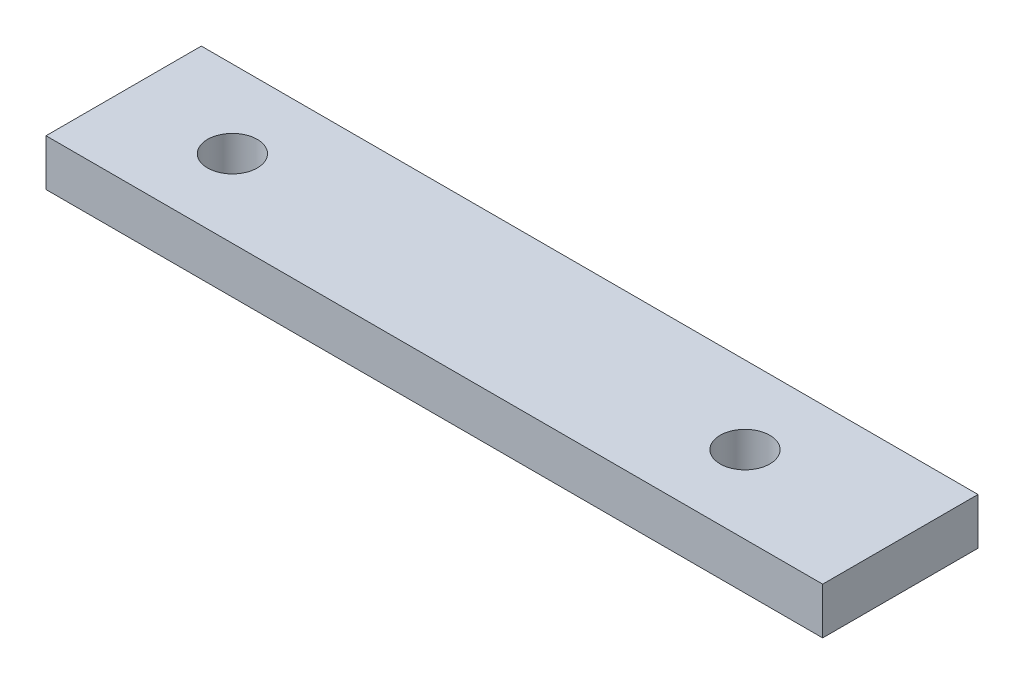
ISO-10303-21;
HEADER;
FILE_DESCRIPTION(('STEP AP214'),'2;1');
FILE_NAME('part.step','',(''),(''),'','','');
FILE_SCHEMA(('AUTOMOTIVE_DESIGN { 1 0 10303 214 1 1 1 1 }'));
ENDSEC;
DATA;
#1=APPLICATION_CONTEXT('core data for automotive mechanical design processes');
#2=APPLICATION_PROTOCOL_DEFINITION('international standard','automotive_design',2000,#1);
#3=PRODUCT_CONTEXT('',#1,'mechanical');
#4=PRODUCT('Part','Part','',(#3));
#5=PRODUCT_RELATED_PRODUCT_CATEGORY('part','',(#4));
#6=PRODUCT_DEFINITION_FORMATION('','',#4);
#7=PRODUCT_DEFINITION_CONTEXT('part definition',#1,'design');
#8=PRODUCT_DEFINITION('design','',#6,#7);
#9=PRODUCT_DEFINITION_SHAPE('','',#8);
#10=(LENGTH_UNIT() NAMED_UNIT(*) SI_UNIT(.MILLI.,.METRE.));
#11=(NAMED_UNIT(*) PLANE_ANGLE_UNIT() SI_UNIT($,.RADIAN.));
#12=(NAMED_UNIT(*) SI_UNIT($,.STERADIAN.) SOLID_ANGLE_UNIT());
#13=UNCERTAINTY_MEASURE_WITH_UNIT(LENGTH_MEASURE(1.E-05),#10,'distance_accuracy_value','');
#14=(GEOMETRIC_REPRESENTATION_CONTEXT(3) GLOBAL_UNCERTAINTY_ASSIGNED_CONTEXT((#13)) GLOBAL_UNIT_ASSIGNED_CONTEXT((#10,
#11,#12)) REPRESENTATION_CONTEXT('',''));
#15=CARTESIAN_POINT('',(0.,0.,0.));
#16=DIRECTION('',(0.,0.,1.));
#17=DIRECTION('',(1.,0.,0.));
#18=AXIS2_PLACEMENT_3D('',#15,#16,#17);
#19=CARTESIAN_POINT('',(0.,3.,0.));
#20=DIRECTION('',(0.,1.,0.));
#21=DIRECTION('',(0.,0.,1.));
#22=AXIS2_PLACEMENT_3D('',#19,#20,#21);
#23=PLANE('',#22);
#24=CARTESIAN_POINT('',(7.00000000000001,3.,-5.));
#25=DIRECTION('',(0.,1.,0.));
#26=DIRECTION('',(0.,0.,1.));
#27=AXIS2_PLACEMENT_3D('',#24,#25,#26);
#28=CIRCLE('',#27,1.6);
#29=CARTESIAN_POINT('',(7.00000000000001,3.,-3.4));
#30=VERTEX_POINT('',#29);
#31=EDGE_CURVE('E102',#30,#30,#28,.T.);
#32=ORIENTED_EDGE('',*,*,#31,.F.);
#33=EDGE_LOOP('',(#32));
#34=FACE_BOUND('',#33,.T.);
#35=DIRECTION('',(-1.,0.,0.));
#36=VECTOR('',#35,1.);
#37=CARTESIAN_POINT('',(0.,3.,-10.));
#38=LINE('',#37,#36);
#39=CARTESIAN_POINT('',(50.,3.,-10.));
#40=VERTEX_POINT('',#39);
#41=CARTESIAN_POINT('',(0.,3.,-10.));
#42=VERTEX_POINT('',#41);
#43=EDGE_CURVE('E87',#40,#42,#38,.T.);
#44=ORIENTED_EDGE('',*,*,#43,.T.);
#45=DIRECTION('',(0.,0.,1.));
#46=VECTOR('',#45,1.);
#47=CARTESIAN_POINT('',(0.,3.,0.));
#48=LINE('',#47,#46);
#49=CARTESIAN_POINT('',(0.,3.,0.));
#50=VERTEX_POINT('',#49);
#51=EDGE_CURVE('E82',#42,#50,#48,.T.);
#52=ORIENTED_EDGE('',*,*,#51,.T.);
#53=DIRECTION('',(1.,0.,0.));
#54=VECTOR('',#53,1.);
#55=CARTESIAN_POINT('',(0.,3.,0.));
#56=LINE('',#55,#54);
#57=CARTESIAN_POINT('',(50.,3.,0.));
#58=VERTEX_POINT('',#57);
#59=EDGE_CURVE('E85',#50,#58,#56,.T.);
#60=ORIENTED_EDGE('',*,*,#59,.T.);
#61=DIRECTION('',(0.,0.,-1.));
#62=VECTOR('',#61,1.);
#63=CARTESIAN_POINT('',(50.,3.,0.));
#64=LINE('',#63,#62);
#65=EDGE_CURVE('E52',#58,#40,#64,.T.);
#66=ORIENTED_EDGE('',*,*,#65,.T.);
#67=EDGE_LOOP('',(#44,#52,#60,#66));
#68=FACE_BOUND('',#67,.T.);
#69=CARTESIAN_POINT('',(40.,3.,-5.));
#70=DIRECTION('',(0.,1.,0.));
#71=DIRECTION('',(0.,0.,1.));
#72=AXIS2_PLACEMENT_3D('',#69,#70,#71);
#73=CIRCLE('',#72,1.60000000000001);
#74=CARTESIAN_POINT('',(40.,3.,-3.4));
#75=VERTEX_POINT('',#74);
#76=EDGE_CURVE('E117',#75,#75,#73,.T.);
#77=ORIENTED_EDGE('',*,*,#76,.F.);
#78=EDGE_LOOP('',(#77));
#79=FACE_BOUND('',#78,.T.);
#80=ADVANCED_FACE('F35',(#34,#68,#79),#23,.T.);
#81=CARTESIAN_POINT('',(0.,0.,0.));
#82=DIRECTION('',(0.,1.,0.));
#83=DIRECTION('',(0.,0.,1.));
#84=AXIS2_PLACEMENT_3D('',#81,#82,#83);
#85=PLANE('',#84);
#86=DIRECTION('',(-1.,0.,0.));
#87=VECTOR('',#86,1.);
#88=CARTESIAN_POINT('',(0.,0.,-10.));
#89=LINE('',#88,#87);
#90=CARTESIAN_POINT('',(50.,0.,-10.));
#91=VERTEX_POINT('',#90);
#92=CARTESIAN_POINT('',(0.,0.,-10.));
#93=VERTEX_POINT('',#92);
#94=EDGE_CURVE('E99',#91,#93,#89,.T.);
#95=ORIENTED_EDGE('',*,*,#94,.F.);
#96=DIRECTION('',(0.,0.,-1.));
#97=VECTOR('',#96,1.);
#98=CARTESIAN_POINT('',(50.,0.,0.));
#99=LINE('',#98,#97);
#100=CARTESIAN_POINT('',(50.,0.,0.));
#101=VERTEX_POINT('',#100);
#102=EDGE_CURVE('E75',#101,#91,#99,.T.);
#103=ORIENTED_EDGE('',*,*,#102,.F.);
#104=DIRECTION('',(1.,0.,0.));
#105=VECTOR('',#104,1.);
#106=CARTESIAN_POINT('',(0.,0.,0.));
#107=LINE('',#106,#105);
#108=CARTESIAN_POINT('',(0.,0.,0.));
#109=VERTEX_POINT('',#108);
#110=EDGE_CURVE('E69',#109,#101,#107,.T.);
#111=ORIENTED_EDGE('',*,*,#110,.F.);
#112=DIRECTION('',(0.,0.,1.));
#113=VECTOR('',#112,1.);
#114=CARTESIAN_POINT('',(0.,0.,0.));
#115=LINE('',#114,#113);
#116=EDGE_CURVE('E91',#93,#109,#115,.T.);
#117=ORIENTED_EDGE('',*,*,#116,.F.);
#118=EDGE_LOOP('',(#95,#103,#111,#117));
#119=FACE_BOUND('',#118,.T.);
#120=CARTESIAN_POINT('',(7.00000000000001,0.,-5.));
#121=DIRECTION('',(0.,1.,0.));
#122=DIRECTION('',(0.,0.,1.));
#123=AXIS2_PLACEMENT_3D('',#120,#121,#122);
#124=CIRCLE('',#123,1.6);
#125=CARTESIAN_POINT('',(7.00000000000001,0.,-3.4));
#126=VERTEX_POINT('',#125);
#127=EDGE_CURVE('E114',#126,#126,#124,.T.);
#128=ORIENTED_EDGE('',*,*,#127,.T.);
#129=EDGE_LOOP('',(#128));
#130=FACE_BOUND('',#129,.T.);
#131=CARTESIAN_POINT('',(40.,0.,-5.));
#132=DIRECTION('',(0.,1.,0.));
#133=DIRECTION('',(0.,0.,1.));
#134=AXIS2_PLACEMENT_3D('',#131,#132,#133);
#135=CIRCLE('',#134,1.60000000000001);
#136=CARTESIAN_POINT('',(40.,0.,-3.4));
#137=VERTEX_POINT('',#136);
#138=EDGE_CURVE('E120',#137,#137,#135,.T.);
#139=ORIENTED_EDGE('',*,*,#138,.T.);
#140=EDGE_LOOP('',(#139));
#141=FACE_BOUND('',#140,.T.);
#142=ADVANCED_FACE('F110',(#119,#130,#141),#85,.F.);
#143=CARTESIAN_POINT('',(0.,3.,-10.));
#144=DIRECTION('',(0.,0.,1.));
#145=DIRECTION('',(1.,0.,0.));
#146=AXIS2_PLACEMENT_3D('',#143,#144,#145);
#147=PLANE('',#146);
#148=ORIENTED_EDGE('',*,*,#94,.T.);
#149=DIRECTION('',(0.,-1.,0.));
#150=VECTOR('',#149,1.);
#151=CARTESIAN_POINT('',(0.,3.,-10.));
#152=LINE('',#151,#150);
#153=EDGE_CURVE('E11',#42,#93,#152,.T.);
#154=ORIENTED_EDGE('',*,*,#153,.F.);
#155=ORIENTED_EDGE('',*,*,#43,.F.);
#156=DIRECTION('',(0.,-1.,0.));
#157=VECTOR('',#156,1.);
#158=CARTESIAN_POINT('',(50.,3.,-10.));
#159=LINE('',#158,#157);
#160=EDGE_CURVE('E95',#40,#91,#159,.T.);
#161=ORIENTED_EDGE('',*,*,#160,.T.);
#162=EDGE_LOOP('',(#148,#154,#155,#161));
#163=FACE_BOUND('',#162,.T.);
#164=ADVANCED_FACE('F37',(#163),#147,.F.);
#165=CARTESIAN_POINT('',(0.,3.,0.));
#166=DIRECTION('',(1.,0.,0.));
#167=DIRECTION('',(0.,0.,-1.));
#168=AXIS2_PLACEMENT_3D('',#165,#166,#167);
#169=PLANE('',#168);
#170=ORIENTED_EDGE('',*,*,#116,.T.);
#171=DIRECTION('',(0.,-1.,0.));
#172=VECTOR('',#171,1.);
#173=CARTESIAN_POINT('',(0.,3.,0.));
#174=LINE('',#173,#172);
#175=EDGE_CURVE('E44',#50,#109,#174,.T.);
#176=ORIENTED_EDGE('',*,*,#175,.F.);
#177=ORIENTED_EDGE('',*,*,#51,.F.);
#178=ORIENTED_EDGE('',*,*,#153,.T.);
#179=EDGE_LOOP('',(#170,#176,#177,#178));
#180=FACE_BOUND('',#179,.T.);
#181=ADVANCED_FACE('F90',(#180),#169,.F.);
#182=CARTESIAN_POINT('',(0.,3.,0.));
#183=DIRECTION('',(0.,0.,-1.));
#184=DIRECTION('',(-1.,0.,0.));
#185=AXIS2_PLACEMENT_3D('',#182,#183,#184);
#186=PLANE('',#185);
#187=ORIENTED_EDGE('',*,*,#110,.T.);
#188=DIRECTION('',(0.,-1.,0.));
#189=VECTOR('',#188,1.);
#190=CARTESIAN_POINT('',(50.,3.,0.));
#191=LINE('',#190,#189);
#192=EDGE_CURVE('E92',#58,#101,#191,.T.);
#193=ORIENTED_EDGE('',*,*,#192,.F.);
#194=ORIENTED_EDGE('',*,*,#59,.F.);
#195=ORIENTED_EDGE('',*,*,#175,.T.);
#196=EDGE_LOOP('',(#187,#193,#194,#195));
#197=FACE_BOUND('',#196,.T.);
#198=ADVANCED_FACE('F93',(#197),#186,.F.);
#199=CARTESIAN_POINT('',(50.,3.,0.));
#200=DIRECTION('',(-1.,0.,0.));
#201=DIRECTION('',(0.,0.,1.));
#202=AXIS2_PLACEMENT_3D('',#199,#200,#201);
#203=PLANE('',#202);
#204=ORIENTED_EDGE('',*,*,#102,.T.);
#205=ORIENTED_EDGE('',*,*,#160,.F.);
#206=ORIENTED_EDGE('',*,*,#65,.F.);
#207=ORIENTED_EDGE('',*,*,#192,.T.);
#208=EDGE_LOOP('',(#204,#205,#206,#207));
#209=FACE_BOUND('',#208,.T.);
#210=ADVANCED_FACE('F107',(#209),#203,.F.);
#211=CARTESIAN_POINT('',(7.00000000000001,3.,-5.));
#212=DIRECTION('',(0.,-1.,0.));
#213=DIRECTION('',(0.,0.,-1.));
#214=AXIS2_PLACEMENT_3D('',#211,#212,#213);
#215=CYLINDRICAL_SURFACE('',#214,1.6);
#216=ORIENTED_EDGE('',*,*,#31,.T.);
#217=EDGE_LOOP('',(#216));
#218=FACE_BOUND('',#217,.T.);
#219=ORIENTED_EDGE('',*,*,#127,.F.);
#220=EDGE_LOOP('',(#219));
#221=FACE_BOUND('',#220,.T.);
#222=ADVANCED_FACE('F137',(#218,#221),#215,.F.);
#223=CARTESIAN_POINT('',(40.,3.,-5.));
#224=DIRECTION('',(0.,-1.,0.));
#225=DIRECTION('',(0.,0.,-1.));
#226=AXIS2_PLACEMENT_3D('',#223,#224,#225);
#227=CYLINDRICAL_SURFACE('',#226,1.60000000000001);
#228=ORIENTED_EDGE('',*,*,#76,.T.);
#229=EDGE_LOOP('',(#228));
#230=FACE_BOUND('',#229,.T.);
#231=ORIENTED_EDGE('',*,*,#138,.F.);
#232=EDGE_LOOP('',(#231));
#233=FACE_BOUND('',#232,.T.);
#234=ADVANCED_FACE('F126',(#230,#233),#227,.F.);
#235=CLOSED_SHELL('',(#80,#142,#164,#181,#198,#210,#222,#234));
#236=MANIFOLD_SOLID_BREP('B2',#235);
#237=ADVANCED_BREP_SHAPE_REPRESENTATION('',(#18,#236),#14);
#238=SHAPE_DEFINITION_REPRESENTATION(#9,#237);
ENDSEC;
END-ISO-10303-21;
